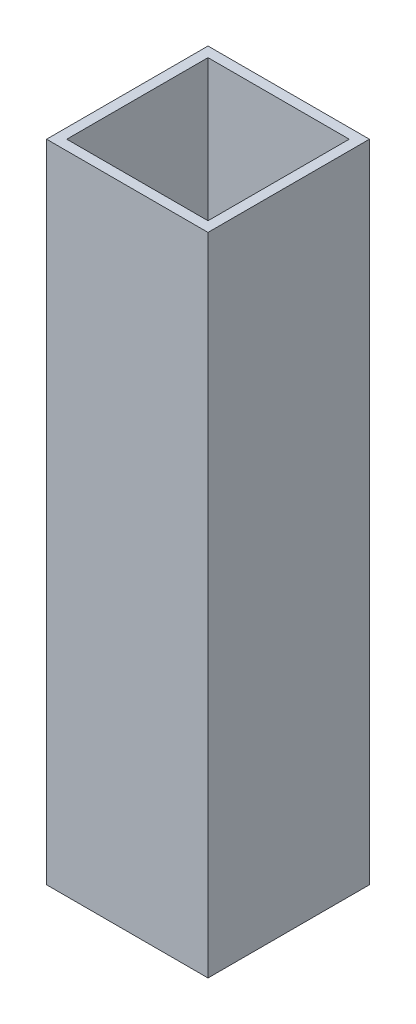
ISO-10303-21;
HEADER;
FILE_DESCRIPTION(('STEP AP214'),'2;1');
FILE_NAME('part.step','',(''),(''),'','','');
FILE_SCHEMA(('AUTOMOTIVE_DESIGN { 1 0 10303 214 1 1 1 1 }'));
ENDSEC;
DATA;
#1=APPLICATION_CONTEXT('core data for automotive mechanical design processes');
#2=APPLICATION_PROTOCOL_DEFINITION('international standard','automotive_design',2000,#1);
#3=PRODUCT_CONTEXT('',#1,'mechanical');
#4=PRODUCT('Part','Part','',(#3));
#5=PRODUCT_RELATED_PRODUCT_CATEGORY('part','',(#4));
#6=PRODUCT_DEFINITION_FORMATION('','',#4);
#7=PRODUCT_DEFINITION_CONTEXT('part definition',#1,'design');
#8=PRODUCT_DEFINITION('design','',#6,#7);
#9=PRODUCT_DEFINITION_SHAPE('','',#8);
#10=(LENGTH_UNIT() NAMED_UNIT(*) SI_UNIT(.MILLI.,.METRE.));
#11=(NAMED_UNIT(*) PLANE_ANGLE_UNIT() SI_UNIT($,.RADIAN.));
#12=(NAMED_UNIT(*) SI_UNIT($,.STERADIAN.) SOLID_ANGLE_UNIT());
#13=UNCERTAINTY_MEASURE_WITH_UNIT(LENGTH_MEASURE(1.E-05),#10,'distance_accuracy_value','');
#14=(GEOMETRIC_REPRESENTATION_CONTEXT(3) GLOBAL_UNCERTAINTY_ASSIGNED_CONTEXT((#13)) GLOBAL_UNIT_ASSIGNED_CONTEXT((#10,
#11,#12)) REPRESENTATION_CONTEXT('',''));
#15=CARTESIAN_POINT('',(0.,0.,0.));
#16=DIRECTION('',(0.,0.,1.));
#17=DIRECTION('',(1.,0.,0.));
#18=AXIS2_PLACEMENT_3D('',#15,#16,#17);
#19=CARTESIAN_POINT('',(0.,101.6,0.));
#20=DIRECTION('',(0.,1.,0.));
#21=DIRECTION('',(0.,0.,1.));
#22=AXIS2_PLACEMENT_3D('',#19,#20,#21);
#23=PLANE('',#22);
#24=DIRECTION('',(0.,0.,-1.));
#25=VECTOR('',#24,1.);
#26=CARTESIAN_POINT('',(12.7,101.6,-12.7));
#27=LINE('',#26,#25);
#28=CARTESIAN_POINT('',(12.7,101.6,12.7));
#29=VERTEX_POINT('',#28);
#30=CARTESIAN_POINT('',(12.7,101.6,-12.7));
#31=VERTEX_POINT('',#30);
#32=EDGE_CURVE('E135',#29,#31,#27,.T.);
#33=ORIENTED_EDGE('',*,*,#32,.T.);
#34=DIRECTION('',(-1.,0.,0.));
#35=VECTOR('',#34,1.);
#36=CARTESIAN_POINT('',(-12.7,101.6,-12.7));
#37=LINE('',#36,#35);
#38=CARTESIAN_POINT('',(-12.7,101.6,-12.7));
#39=VERTEX_POINT('',#38);
#40=EDGE_CURVE('E138',#31,#39,#37,.T.);
#41=ORIENTED_EDGE('',*,*,#40,.T.);
#42=DIRECTION('',(0.,0.,1.));
#43=VECTOR('',#42,1.);
#44=CARTESIAN_POINT('',(-12.7,101.6,-12.7));
#45=LINE('',#44,#43);
#46=CARTESIAN_POINT('',(-12.7,101.6,12.7));
#47=VERTEX_POINT('',#46);
#48=EDGE_CURVE('E141',#39,#47,#45,.T.);
#49=ORIENTED_EDGE('',*,*,#48,.T.);
#50=DIRECTION('',(1.,0.,0.));
#51=VECTOR('',#50,1.);
#52=CARTESIAN_POINT('',(-12.7,101.6,12.7));
#53=LINE('',#52,#51);
#54=EDGE_CURVE('E143',#47,#29,#53,.T.);
#55=ORIENTED_EDGE('',*,*,#54,.T.);
#56=EDGE_LOOP('',(#33,#41,#49,#55));
#57=FACE_BOUND('',#56,.T.);
#58=DIRECTION('',(1.,0.,0.));
#59=VECTOR('',#58,1.);
#60=CARTESIAN_POINT('',(-11.1125,101.6,11.1125));
#61=LINE('',#60,#59);
#62=CARTESIAN_POINT('',(-11.1125,101.6,11.1125));
#63=VERTEX_POINT('',#62);
#64=CARTESIAN_POINT('',(11.1125,101.6,11.1125));
#65=VERTEX_POINT('',#64);
#66=EDGE_CURVE('E107',#63,#65,#61,.T.);
#67=ORIENTED_EDGE('',*,*,#66,.F.);
#68=DIRECTION('',(0.,0.,1.));
#69=VECTOR('',#68,1.);
#70=CARTESIAN_POINT('',(-11.1125,101.6,-11.1125));
#71=LINE('',#70,#69);
#72=CARTESIAN_POINT('',(-11.1125,101.6,-11.1125));
#73=VERTEX_POINT('',#72);
#74=EDGE_CURVE('E99',#73,#63,#71,.T.);
#75=ORIENTED_EDGE('',*,*,#74,.F.);
#76=DIRECTION('',(-1.,0.,0.));
#77=VECTOR('',#76,1.);
#78=CARTESIAN_POINT('',(-11.1125,101.6,-11.1125));
#79=LINE('',#78,#77);
#80=CARTESIAN_POINT('',(11.1125,101.6,-11.1125));
#81=VERTEX_POINT('',#80);
#82=EDGE_CURVE('E121',#81,#73,#79,.T.);
#83=ORIENTED_EDGE('',*,*,#82,.F.);
#84=DIRECTION('',(0.,0.,-1.));
#85=VECTOR('',#84,1.);
#86=CARTESIAN_POINT('',(11.1125,101.6,-11.1125));
#87=LINE('',#86,#85);
#88=EDGE_CURVE('E119',#65,#81,#87,.T.);
#89=ORIENTED_EDGE('',*,*,#88,.F.);
#90=EDGE_LOOP('',(#67,#75,#83,#89));
#91=FACE_BOUND('',#90,.T.);
#92=ADVANCED_FACE('F34',(#57,#91),#23,.T.);
#93=CARTESIAN_POINT('',(0.,0.,0.));
#94=DIRECTION('',(0.,1.,0.));
#95=DIRECTION('',(0.,0.,1.));
#96=AXIS2_PLACEMENT_3D('',#93,#94,#95);
#97=PLANE('',#96);
#98=DIRECTION('',(0.,0.,-1.));
#99=VECTOR('',#98,1.);
#100=CARTESIAN_POINT('',(12.7,0.,-12.7));
#101=LINE('',#100,#99);
#102=CARTESIAN_POINT('',(12.7,0.,12.7));
#103=VERTEX_POINT('',#102);
#104=CARTESIAN_POINT('',(12.7,0.,-12.7));
#105=VERTEX_POINT('',#104);
#106=EDGE_CURVE('E115',#103,#105,#101,.T.);
#107=ORIENTED_EDGE('',*,*,#106,.F.);
#108=DIRECTION('',(1.,0.,0.));
#109=VECTOR('',#108,1.);
#110=CARTESIAN_POINT('',(-12.7,0.,12.7));
#111=LINE('',#110,#109);
#112=CARTESIAN_POINT('',(-12.7,0.,12.7));
#113=VERTEX_POINT('',#112);
#114=EDGE_CURVE('E139',#113,#103,#111,.T.);
#115=ORIENTED_EDGE('',*,*,#114,.F.);
#116=DIRECTION('',(0.,0.,1.));
#117=VECTOR('',#116,1.);
#118=CARTESIAN_POINT('',(-12.7,0.,-12.7));
#119=LINE('',#118,#117);
#120=CARTESIAN_POINT('',(-12.7,0.,-12.7));
#121=VERTEX_POINT('',#120);
#122=EDGE_CURVE('E150',#121,#113,#119,.T.);
#123=ORIENTED_EDGE('',*,*,#122,.F.);
#124=DIRECTION('',(-1.,0.,0.));
#125=VECTOR('',#124,1.);
#126=CARTESIAN_POINT('',(-12.7,0.,-12.7));
#127=LINE('',#126,#125);
#128=EDGE_CURVE('E148',#105,#121,#127,.T.);
#129=ORIENTED_EDGE('',*,*,#128,.F.);
#130=EDGE_LOOP('',(#107,#115,#123,#129));
#131=FACE_BOUND('',#130,.T.);
#132=DIRECTION('',(0.,0.,1.));
#133=VECTOR('',#132,1.);
#134=CARTESIAN_POINT('',(-11.1125,0.,-11.1125));
#135=LINE('',#134,#133);
#136=CARTESIAN_POINT('',(-11.1125,0.,-11.1125));
#137=VERTEX_POINT('',#136);
#138=CARTESIAN_POINT('',(-11.1125,0.,11.1125));
#139=VERTEX_POINT('',#138);
#140=EDGE_CURVE('E57',#137,#139,#135,.T.);
#141=ORIENTED_EDGE('',*,*,#140,.T.);
#142=DIRECTION('',(1.,0.,0.));
#143=VECTOR('',#142,1.);
#144=CARTESIAN_POINT('',(-11.1125,0.,11.1125));
#145=LINE('',#144,#143);
#146=CARTESIAN_POINT('',(11.1125,0.,11.1125));
#147=VERTEX_POINT('',#146);
#148=EDGE_CURVE('E114',#139,#147,#145,.T.);
#149=ORIENTED_EDGE('',*,*,#148,.T.);
#150=DIRECTION('',(0.,0.,-1.));
#151=VECTOR('',#150,1.);
#152=CARTESIAN_POINT('',(11.1125,0.,-11.1125));
#153=LINE('',#152,#151);
#154=CARTESIAN_POINT('',(11.1125,0.,-11.1125));
#155=VERTEX_POINT('',#154);
#156=EDGE_CURVE('E127',#147,#155,#153,.T.);
#157=ORIENTED_EDGE('',*,*,#156,.T.);
#158=DIRECTION('',(-1.,0.,0.));
#159=VECTOR('',#158,1.);
#160=CARTESIAN_POINT('',(-11.1125,0.,-11.1125));
#161=LINE('',#160,#159);
#162=EDGE_CURVE('E108',#155,#137,#161,.T.);
#163=ORIENTED_EDGE('',*,*,#162,.T.);
#164=EDGE_LOOP('',(#141,#149,#157,#163));
#165=FACE_BOUND('',#164,.T.);
#166=ADVANCED_FACE('F168',(#131,#165),#97,.F.);
#167=CARTESIAN_POINT('',(12.7,101.6,-12.7));
#168=DIRECTION('',(-1.,0.,0.));
#169=DIRECTION('',(0.,0.,1.));
#170=AXIS2_PLACEMENT_3D('',#167,#168,#169);
#171=PLANE('',#170);
#172=ORIENTED_EDGE('',*,*,#106,.T.);
#173=DIRECTION('',(0.,-1.,0.));
#174=VECTOR('',#173,1.);
#175=CARTESIAN_POINT('',(12.7,101.6,-12.7));
#176=LINE('',#175,#174);
#177=EDGE_CURVE('E11',#31,#105,#176,.T.);
#178=ORIENTED_EDGE('',*,*,#177,.F.);
#179=ORIENTED_EDGE('',*,*,#32,.F.);
#180=DIRECTION('',(0.,-1.,0.));
#181=VECTOR('',#180,1.);
#182=CARTESIAN_POINT('',(12.7,101.6,12.7));
#183=LINE('',#182,#181);
#184=EDGE_CURVE('E145',#29,#103,#183,.T.);
#185=ORIENTED_EDGE('',*,*,#184,.T.);
#186=EDGE_LOOP('',(#172,#178,#179,#185));
#187=FACE_BOUND('',#186,.T.);
#188=ADVANCED_FACE('F36',(#187),#171,.F.);
#189=CARTESIAN_POINT('',(-12.7,101.6,-12.7));
#190=DIRECTION('',(0.,0.,1.));
#191=DIRECTION('',(1.,0.,0.));
#192=AXIS2_PLACEMENT_3D('',#189,#190,#191);
#193=PLANE('',#192);
#194=ORIENTED_EDGE('',*,*,#128,.T.);
#195=DIRECTION('',(0.,-1.,0.));
#196=VECTOR('',#195,1.);
#197=CARTESIAN_POINT('',(-12.7,101.6,-12.7));
#198=LINE('',#197,#196);
#199=EDGE_CURVE('E42',#39,#121,#198,.T.);
#200=ORIENTED_EDGE('',*,*,#199,.F.);
#201=ORIENTED_EDGE('',*,*,#40,.F.);
#202=ORIENTED_EDGE('',*,*,#177,.T.);
#203=EDGE_LOOP('',(#194,#200,#201,#202));
#204=FACE_BOUND('',#203,.T.);
#205=ADVANCED_FACE('F178',(#204),#193,.F.);
#206=CARTESIAN_POINT('',(-12.7,101.6,-12.7));
#207=DIRECTION('',(1.,0.,0.));
#208=DIRECTION('',(0.,0.,-1.));
#209=AXIS2_PLACEMENT_3D('',#206,#207,#208);
#210=PLANE('',#209);
#211=ORIENTED_EDGE('',*,*,#122,.T.);
#212=DIRECTION('',(0.,-1.,0.));
#213=VECTOR('',#212,1.);
#214=CARTESIAN_POINT('',(-12.7,101.6,12.7));
#215=LINE('',#214,#213);
#216=EDGE_CURVE('E155',#47,#113,#215,.T.);
#217=ORIENTED_EDGE('',*,*,#216,.F.);
#218=ORIENTED_EDGE('',*,*,#48,.F.);
#219=ORIENTED_EDGE('',*,*,#199,.T.);
#220=EDGE_LOOP('',(#211,#217,#218,#219));
#221=FACE_BOUND('',#220,.T.);
#222=ADVANCED_FACE('F162',(#221),#210,.F.);
#223=CARTESIAN_POINT('',(-12.7,101.6,12.7));
#224=DIRECTION('',(0.,0.,-1.));
#225=DIRECTION('',(-1.,0.,0.));
#226=AXIS2_PLACEMENT_3D('',#223,#224,#225);
#227=PLANE('',#226);
#228=ORIENTED_EDGE('',*,*,#114,.T.);
#229=ORIENTED_EDGE('',*,*,#184,.F.);
#230=ORIENTED_EDGE('',*,*,#54,.F.);
#231=ORIENTED_EDGE('',*,*,#216,.T.);
#232=EDGE_LOOP('',(#228,#229,#230,#231));
#233=FACE_BOUND('',#232,.T.);
#234=ADVANCED_FACE('F172',(#233),#227,.F.);
#235=CARTESIAN_POINT('',(-11.1125,101.6,-11.1125));
#236=DIRECTION('',(1.,0.,0.));
#237=DIRECTION('',(0.,0.,-1.));
#238=AXIS2_PLACEMENT_3D('',#235,#236,#237);
#239=PLANE('',#238);
#240=ORIENTED_EDGE('',*,*,#140,.F.);
#241=DIRECTION('',(0.,-1.,0.));
#242=VECTOR('',#241,1.);
#243=CARTESIAN_POINT('',(-11.1125,101.6,-11.1125));
#244=LINE('',#243,#242);
#245=EDGE_CURVE('E103',#73,#137,#244,.T.);
#246=ORIENTED_EDGE('',*,*,#245,.F.);
#247=ORIENTED_EDGE('',*,*,#74,.T.);
#248=DIRECTION('',(0.,-1.,0.));
#249=VECTOR('',#248,1.);
#250=CARTESIAN_POINT('',(-11.1125,101.6,11.1125));
#251=LINE('',#250,#249);
#252=EDGE_CURVE('E102',#63,#139,#251,.T.);
#253=ORIENTED_EDGE('',*,*,#252,.T.);
#254=EDGE_LOOP('',(#240,#246,#247,#253));
#255=FACE_BOUND('',#254,.T.);
#256=ADVANCED_FACE('F101',(#255),#239,.T.);
#257=CARTESIAN_POINT('',(-11.1125,101.6,11.1125));
#258=DIRECTION('',(0.,0.,-1.));
#259=DIRECTION('',(-1.,0.,0.));
#260=AXIS2_PLACEMENT_3D('',#257,#258,#259);
#261=PLANE('',#260);
#262=ORIENTED_EDGE('',*,*,#148,.F.);
#263=ORIENTED_EDGE('',*,*,#252,.F.);
#264=ORIENTED_EDGE('',*,*,#66,.T.);
#265=DIRECTION('',(0.,-1.,0.));
#266=VECTOR('',#265,1.);
#267=CARTESIAN_POINT('',(11.1125,101.6,11.1125));
#268=LINE('',#267,#266);
#269=EDGE_CURVE('E116',#65,#147,#268,.T.);
#270=ORIENTED_EDGE('',*,*,#269,.T.);
#271=EDGE_LOOP('',(#262,#263,#264,#270));
#272=FACE_BOUND('',#271,.T.);
#273=ADVANCED_FACE('F111',(#272),#261,.T.);
#274=CARTESIAN_POINT('',(11.1125,101.6,-11.1125));
#275=DIRECTION('',(-1.,0.,0.));
#276=DIRECTION('',(0.,0.,1.));
#277=AXIS2_PLACEMENT_3D('',#274,#275,#276);
#278=PLANE('',#277);
#279=ORIENTED_EDGE('',*,*,#156,.F.);
#280=ORIENTED_EDGE('',*,*,#269,.F.);
#281=ORIENTED_EDGE('',*,*,#88,.T.);
#282=DIRECTION('',(0.,-1.,0.));
#283=VECTOR('',#282,1.);
#284=CARTESIAN_POINT('',(11.1125,101.6,-11.1125));
#285=LINE('',#284,#283);
#286=EDGE_CURVE('E49',#81,#155,#285,.T.);
#287=ORIENTED_EDGE('',*,*,#286,.T.);
#288=EDGE_LOOP('',(#279,#280,#281,#287));
#289=FACE_BOUND('',#288,.T.);
#290=ADVANCED_FACE('F201',(#289),#278,.T.);
#291=CARTESIAN_POINT('',(-11.1125,101.6,-11.1125));
#292=DIRECTION('',(0.,0.,1.));
#293=DIRECTION('',(1.,0.,0.));
#294=AXIS2_PLACEMENT_3D('',#291,#292,#293);
#295=PLANE('',#294);
#296=ORIENTED_EDGE('',*,*,#162,.F.);
#297=ORIENTED_EDGE('',*,*,#286,.F.);
#298=ORIENTED_EDGE('',*,*,#82,.T.);
#299=ORIENTED_EDGE('',*,*,#245,.T.);
#300=EDGE_LOOP('',(#296,#297,#298,#299));
#301=FACE_BOUND('',#300,.T.);
#302=ADVANCED_FACE('F205',(#301),#295,.T.);
#303=CLOSED_SHELL('',(#92,#166,#188,#205,#222,#234,#256,#273,#290,#302));
#304=MANIFOLD_SOLID_BREP('B2',#303);
#305=ADVANCED_BREP_SHAPE_REPRESENTATION('',(#18,#304),#14);
#306=SHAPE_DEFINITION_REPRESENTATION(#9,#305);
ENDSEC;
END-ISO-10303-21;
